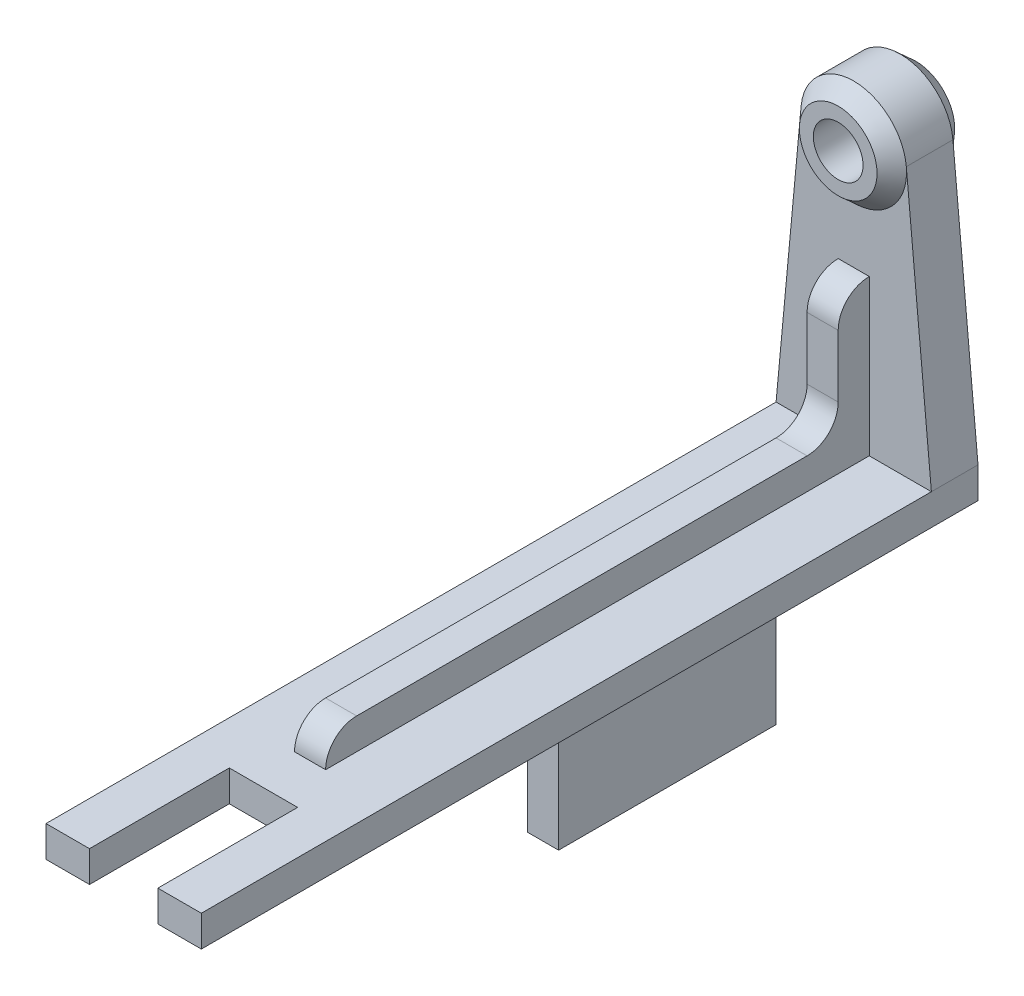
ISO-10303-21;
HEADER;
FILE_DESCRIPTION(('STEP AP214'),'2;1');
FILE_NAME('part.step','',(''),(''),'','','');
FILE_SCHEMA(('AUTOMOTIVE_DESIGN { 1 0 10303 214 1 1 1 1 }'));
ENDSEC;
DATA;
#1=APPLICATION_CONTEXT('core data for automotive mechanical design processes');
#2=APPLICATION_PROTOCOL_DEFINITION('international standard','automotive_design',2000,#1);
#3=PRODUCT_CONTEXT('',#1,'mechanical');
#4=PRODUCT('Part','Part','',(#3));
#5=PRODUCT_RELATED_PRODUCT_CATEGORY('part','',(#4));
#6=PRODUCT_DEFINITION_FORMATION('','',#4);
#7=PRODUCT_DEFINITION_CONTEXT('part definition',#1,'design');
#8=PRODUCT_DEFINITION('design','',#6,#7);
#9=PRODUCT_DEFINITION_SHAPE('','',#8);
#10=(LENGTH_UNIT() NAMED_UNIT(*) SI_UNIT(.MILLI.,.METRE.));
#11=(NAMED_UNIT(*) PLANE_ANGLE_UNIT() SI_UNIT($,.RADIAN.));
#12=(NAMED_UNIT(*) SI_UNIT($,.STERADIAN.) SOLID_ANGLE_UNIT());
#13=UNCERTAINTY_MEASURE_WITH_UNIT(LENGTH_MEASURE(1.E-05),#10,'distance_accuracy_value','');
#14=(GEOMETRIC_REPRESENTATION_CONTEXT(3) GLOBAL_UNCERTAINTY_ASSIGNED_CONTEXT((#13)) GLOBAL_UNIT_ASSIGNED_CONTEXT((#10,
#11,#12)) REPRESENTATION_CONTEXT('',''));
#15=CARTESIAN_POINT('',(0.,0.,0.));
#16=DIRECTION('',(0.,0.,1.));
#17=DIRECTION('',(1.,0.,0.));
#18=AXIS2_PLACEMENT_3D('',#15,#16,#17);
#19=CARTESIAN_POINT('',(0.,0.,242.5));
#20=DIRECTION('',(0.,0.,-1.));
#21=DIRECTION('',(-1.,0.,0.));
#22=AXIS2_PLACEMENT_3D('',#19,#20,#21);
#23=PLANE('',#22);
#24=DIRECTION('',(0.,1.,0.));
#25=VECTOR('',#24,1.);
#26=CARTESIAN_POINT('',(11.,0.,242.5));
#27=LINE('',#26,#25);
#28=CARTESIAN_POINT('',(11.,-95.,242.5));
#29=VERTEX_POINT('',#28);
#30=CARTESIAN_POINT('',(11.,-85.,242.5));
#31=VERTEX_POINT('',#30);
#32=EDGE_CURVE('E372',#29,#31,#27,.T.);
#33=ORIENTED_EDGE('',*,*,#32,.F.);
#34=DIRECTION('',(1.,0.,0.));
#35=VECTOR('',#34,1.);
#36=CARTESIAN_POINT('',(-25.,-95.,242.5));
#37=LINE('',#36,#35);
#38=CARTESIAN_POINT('',(25.,-95.,242.5));
#39=VERTEX_POINT('',#38);
#40=EDGE_CURVE('E207',#29,#39,#37,.T.);
#41=ORIENTED_EDGE('',*,*,#40,.T.);
#42=DIRECTION('',(0.,1.,0.));
#43=VECTOR('',#42,1.);
#44=CARTESIAN_POINT('',(25.,-95.,242.5));
#45=LINE('',#44,#43);
#46=CARTESIAN_POINT('',(25.,-85.,242.5));
#47=VERTEX_POINT('',#46);
#48=EDGE_CURVE('E319',#39,#47,#45,.T.);
#49=ORIENTED_EDGE('',*,*,#48,.T.);
#50=DIRECTION('',(-1.,0.,0.));
#51=VECTOR('',#50,1.);
#52=CARTESIAN_POINT('',(-25.,-85.,242.5));
#53=LINE('',#52,#51);
#54=EDGE_CURVE('E322',#47,#31,#53,.T.);
#55=ORIENTED_EDGE('',*,*,#54,.T.);
#56=EDGE_LOOP('',(#33,#41,#49,#55));
#57=FACE_BOUND('',#56,.T.);
#58=ADVANCED_FACE('F33',(#57),#23,.F.);
#59=CARTESIAN_POINT('',(0.,0.,7.5));
#60=DIRECTION('',(0.,0.,1.));
#61=DIRECTION('',(1.,0.,0.));
#62=AXIS2_PLACEMENT_3D('',#59,#60,#61);
#63=PLANE('',#62);
#64=DIRECTION('',(0.,1.,0.));
#65=VECTOR('',#64,1.);
#66=CARTESIAN_POINT('',(5.,-85.,7.5));
#67=LINE('',#66,#65);
#68=CARTESIAN_POINT('',(5.,-85.,7.5));
#69=VERTEX_POINT('',#68);
#70=CARTESIAN_POINT('',(5.,-35.,7.5));
#71=VERTEX_POINT('',#70);
#72=EDGE_CURVE('E251',#69,#71,#67,.T.);
#73=ORIENTED_EDGE('',*,*,#72,.F.);
#74=DIRECTION('',(-1.,0.,0.));
#75=VECTOR('',#74,1.);
#76=CARTESIAN_POINT('',(-25.,-85.,7.5));
#77=LINE('',#76,#75);
#78=CARTESIAN_POINT('',(25.,-85.,7.5));
#79=VERTEX_POINT('',#78);
#80=EDGE_CURVE('E315',#79,#69,#77,.T.);
#81=ORIENTED_EDGE('',*,*,#80,.F.);
#82=DIRECTION('',(-0.0928471682589601,0.995680372080465,0.));
#83=VECTOR('',#82,1.);
#84=CARTESIAN_POINT('',(25.,-85.,7.5));
#85=LINE('',#84,#83);
#86=CARTESIAN_POINT('',(16.9265663253679,1.57840186040232,7.50000000000006));
#87=VERTEX_POINT('',#86);
#88=EDGE_CURVE('E334',#79,#87,#85,.T.);
#89=ORIENTED_EDGE('',*,*,#88,.T.);
#90=CARTESIAN_POINT('',(0.,0.,7.5));
#91=DIRECTION('',(0.,0.,1.));
#92=DIRECTION('',(1.,0.,0.));
#93=AXIS2_PLACEMENT_3D('',#90,#91,#92);
#94=CIRCLE('',#93,17.0000000000001);
#95=CARTESIAN_POINT('',(-16.9265663253679,1.57840186040232,7.5));
#96=VERTEX_POINT('',#95);
#97=EDGE_CURVE('E363',#87,#96,#94,.F.);
#98=ORIENTED_EDGE('',*,*,#97,.T.);
#99=DIRECTION('',(-0.0928471682589601,-0.995680372080465,0.));
#100=VECTOR('',#99,1.);
#101=CARTESIAN_POINT('',(-25.,-85.,7.5));
#102=LINE('',#101,#100);
#103=CARTESIAN_POINT('',(-25.,-85.,7.5));
#104=VERTEX_POINT('',#103);
#105=EDGE_CURVE('E340',#96,#104,#102,.T.);
#106=ORIENTED_EDGE('',*,*,#105,.T.);
#107=CARTESIAN_POINT('',(-5.,-85.,7.5));
#108=VERTEX_POINT('',#107);
#109=EDGE_CURVE('E311',#108,#104,#77,.T.);
#110=ORIENTED_EDGE('',*,*,#109,.F.);
#111=DIRECTION('',(0.,1.,0.));
#112=VECTOR('',#111,1.);
#113=CARTESIAN_POINT('',(-5.,-85.,7.5));
#114=LINE('',#113,#112);
#115=CARTESIAN_POINT('',(-5.,-35.,7.5));
#116=VERTEX_POINT('',#115);
#117=EDGE_CURVE('E269',#108,#116,#114,.T.);
#118=ORIENTED_EDGE('',*,*,#117,.T.);
#119=DIRECTION('',(-1.,0.,0.));
#120=VECTOR('',#119,1.);
#121=CARTESIAN_POINT('',(5.,-35.,7.5));
#122=LINE('',#121,#120);
#123=EDGE_CURVE('E294',#71,#116,#122,.T.);
#124=ORIENTED_EDGE('',*,*,#123,.F.);
#125=EDGE_LOOP('',(#73,#81,#89,#98,#106,#110,#118,#124));
#126=FACE_BOUND('',#125,.T.);
#127=ADVANCED_FACE('F421',(#126),#63,.T.);
#128=CARTESIAN_POINT('',(25.,-85.,7.5));
#129=DIRECTION('',(-1.,0.,0.));
#130=DIRECTION('',(0.,-1.,0.));
#131=AXIS2_PLACEMENT_3D('',#128,#129,#130);
#132=PLANE('',#131);
#133=DIRECTION('',(0.,1.,0.));
#134=VECTOR('',#133,1.);
#135=CARTESIAN_POINT('',(25.,-85.,-7.5));
#136=LINE('',#135,#134);
#137=CARTESIAN_POINT('',(25.,-95.,-7.5));
#138=VERTEX_POINT('',#137);
#139=CARTESIAN_POINT('',(25.,-85.,-7.5));
#140=VERTEX_POINT('',#139);
#141=EDGE_CURVE('E333',#138,#140,#136,.T.);
#142=ORIENTED_EDGE('',*,*,#141,.T.);
#143=DIRECTION('',(0.,0.,-1.));
#144=VECTOR('',#143,1.);
#145=CARTESIAN_POINT('',(25.,-85.,7.5));
#146=LINE('',#145,#144);
#147=EDGE_CURVE('E360',#79,#140,#146,.T.);
#148=ORIENTED_EDGE('',*,*,#147,.F.);
#149=DIRECTION('',(0.,0.,-1.));
#150=VECTOR('',#149,1.);
#151=CARTESIAN_POINT('',(25.,-85.,242.5));
#152=LINE('',#151,#150);
#153=EDGE_CURVE('E330',#47,#79,#152,.T.);
#154=ORIENTED_EDGE('',*,*,#153,.F.);
#155=ORIENTED_EDGE('',*,*,#48,.F.);
#156=DIRECTION('',(0.,0.,-1.));
#157=VECTOR('',#156,1.);
#158=CARTESIAN_POINT('',(25.,-95.,7.5));
#159=LINE('',#158,#157);
#160=EDGE_CURVE('E343',#39,#138,#159,.T.);
#161=ORIENTED_EDGE('',*,*,#160,.T.);
#162=EDGE_LOOP('',(#142,#148,#154,#155,#161));
#163=FACE_BOUND('',#162,.T.);
#164=ADVANCED_FACE('F35',(#163),#132,.F.);
#165=CARTESIAN_POINT('',(25.,-85.,7.5));
#166=DIRECTION('',(-0.995680372080465,-0.0928471682589601,0.));
#167=DIRECTION('',(0.0928471682589601,-0.995680372080465,0.));
#168=AXIS2_PLACEMENT_3D('',#165,#166,#167);
#169=PLANE('',#168);
#170=DIRECTION('',(-0.0928471682589601,0.995680372080465,0.));
#171=VECTOR('',#170,1.);
#172=CARTESIAN_POINT('',(25.,-85.,-7.5));
#173=LINE('',#172,#171);
#174=CARTESIAN_POINT('',(16.9265663253679,1.57840186040232,-7.5));
#175=VERTEX_POINT('',#174);
#176=EDGE_CURVE('E346',#140,#175,#173,.T.);
#177=ORIENTED_EDGE('',*,*,#176,.T.);
#178=DIRECTION('',(0.,0.,-1.));
#179=VECTOR('',#178,1.);
#180=CARTESIAN_POINT('',(16.9265663253679,1.57840186040232,7.5));
#181=LINE('',#180,#179);
#182=EDGE_CURVE('E364',#87,#175,#181,.T.);
#183=ORIENTED_EDGE('',*,*,#182,.F.);
#184=ORIENTED_EDGE('',*,*,#88,.F.);
#185=ORIENTED_EDGE('',*,*,#147,.T.);
#186=EDGE_LOOP('',(#177,#183,#184,#185));
#187=FACE_BOUND('',#186,.T.);
#188=ADVANCED_FACE('F456',(#187),#169,.F.);
#189=CARTESIAN_POINT('',(0.,0.,7.5));
#190=DIRECTION('',(0.,0.,-1.));
#191=DIRECTION('',(-1.,0.,0.));
#192=AXIS2_PLACEMENT_3D('',#189,#190,#191);
#193=CYLINDRICAL_SURFACE('',#192,17.);
#194=CARTESIAN_POINT('',(0.,0.,-7.5));
#195=DIRECTION('',(0.,0.,1.));
#196=DIRECTION('',(1.,0.,0.));
#197=AXIS2_PLACEMENT_3D('',#194,#195,#196);
#198=CIRCLE('',#197,17.);
#199=CARTESIAN_POINT('',(-16.9265663253679,1.57840186040232,-7.50000000000006));
#200=VERTEX_POINT('',#199);
#201=EDGE_CURVE('E375',#175,#200,#198,.T.);
#202=ORIENTED_EDGE('',*,*,#201,.T.);
#203=DIRECTION('',(0.,0.,-1.));
#204=VECTOR('',#203,1.);
#205=CARTESIAN_POINT('',(-16.9265663253679,1.57840186040232,7.5));
#206=LINE('',#205,#204);
#207=EDGE_CURVE('E359',#96,#200,#206,.T.);
#208=ORIENTED_EDGE('',*,*,#207,.F.);
#209=CARTESIAN_POINT('',(0.,0.,7.5));
#210=DIRECTION('',(0.,0.,1.));
#211=DIRECTION('',(1.,0.,0.));
#212=AXIS2_PLACEMENT_3D('',#209,#210,#211);
#213=CIRCLE('',#212,17.);
#214=EDGE_CURVE('E337',#87,#96,#213,.T.);
#215=ORIENTED_EDGE('',*,*,#214,.F.);
#216=ORIENTED_EDGE('',*,*,#182,.T.);
#217=EDGE_LOOP('',(#202,#208,#215,#216));
#218=FACE_BOUND('',#217,.T.);
#219=ADVANCED_FACE('F453',(#218),#193,.T.);
#220=CARTESIAN_POINT('',(-25.,-85.,7.5));
#221=DIRECTION('',(0.995680372080465,-0.0928471682589601,0.));
#222=DIRECTION('',(0.0928471682589601,0.995680372080465,0.));
#223=AXIS2_PLACEMENT_3D('',#220,#221,#222);
#224=PLANE('',#223);
#225=DIRECTION('',(-0.0928471682589601,-0.995680372080465,0.));
#226=VECTOR('',#225,1.);
#227=CARTESIAN_POINT('',(-25.,-85.,-7.5));
#228=LINE('',#227,#226);
#229=CARTESIAN_POINT('',(-25.,-85.,-7.5));
#230=VERTEX_POINT('',#229);
#231=EDGE_CURVE('E349',#200,#230,#228,.T.);
#232=ORIENTED_EDGE('',*,*,#231,.T.);
#233=DIRECTION('',(0.,0.,-1.));
#234=VECTOR('',#233,1.);
#235=CARTESIAN_POINT('',(-25.,-85.,7.5));
#236=LINE('',#235,#234);
#237=EDGE_CURVE('E356',#104,#230,#236,.T.);
#238=ORIENTED_EDGE('',*,*,#237,.F.);
#239=ORIENTED_EDGE('',*,*,#105,.F.);
#240=ORIENTED_EDGE('',*,*,#207,.T.);
#241=EDGE_LOOP('',(#232,#238,#239,#240));
#242=FACE_BOUND('',#241,.T.);
#243=ADVANCED_FACE('F450',(#242),#224,.F.);
#244=CARTESIAN_POINT('',(-25.,-85.,7.5));
#245=DIRECTION('',(1.,0.,0.));
#246=DIRECTION('',(0.,1.,0.));
#247=AXIS2_PLACEMENT_3D('',#244,#245,#246);
#248=PLANE('',#247);
#249=DIRECTION('',(0.,-1.,0.));
#250=VECTOR('',#249,1.);
#251=CARTESIAN_POINT('',(-25.,-85.,-7.5));
#252=LINE('',#251,#250);
#253=CARTESIAN_POINT('',(-25.,-95.,-7.5));
#254=VERTEX_POINT('',#253);
#255=EDGE_CURVE('E347',#230,#254,#252,.T.);
#256=ORIENTED_EDGE('',*,*,#255,.T.);
#257=DIRECTION('',(0.,0.,-1.));
#258=VECTOR('',#257,1.);
#259=CARTESIAN_POINT('',(-25.,-95.,7.5));
#260=LINE('',#259,#258);
#261=CARTESIAN_POINT('',(-25.,-95.,242.5));
#262=VERTEX_POINT('',#261);
#263=EDGE_CURVE('E353',#262,#254,#260,.T.);
#264=ORIENTED_EDGE('',*,*,#263,.F.);
#265=DIRECTION('',(0.,-1.,0.));
#266=VECTOR('',#265,1.);
#267=CARTESIAN_POINT('',(-25.,-95.,242.5));
#268=LINE('',#267,#266);
#269=CARTESIAN_POINT('',(-25.,-85.,242.5));
#270=VERTEX_POINT('',#269);
#271=EDGE_CURVE('E312',#270,#262,#268,.T.);
#272=ORIENTED_EDGE('',*,*,#271,.F.);
#273=DIRECTION('',(0.,0.,-1.));
#274=VECTOR('',#273,1.);
#275=CARTESIAN_POINT('',(-25.,-85.,242.5));
#276=LINE('',#275,#274);
#277=EDGE_CURVE('E325',#270,#104,#276,.T.);
#278=ORIENTED_EDGE('',*,*,#277,.T.);
#279=ORIENTED_EDGE('',*,*,#237,.T.);
#280=EDGE_LOOP('',(#256,#264,#272,#278,#279));
#281=FACE_BOUND('',#280,.T.);
#282=ADVANCED_FACE('F406',(#281),#248,.F.);
#283=CARTESIAN_POINT('',(-25.,-95.,7.5));
#284=DIRECTION('',(0.,1.,0.));
#285=DIRECTION('',(0.,0.,1.));
#286=AXIS2_PLACEMENT_3D('',#283,#284,#285);
#287=PLANE('',#286);
#288=DIRECTION('',(-1.,0.,0.));
#289=VECTOR('',#288,1.);
#290=CARTESIAN_POINT('',(5.,-95.,107.5));
#291=LINE('',#290,#289);
#292=CARTESIAN_POINT('',(5.,-95.,107.5));
#293=VERTEX_POINT('',#292);
#294=CARTESIAN_POINT('',(-5.,-95.,107.5));
#295=VERTEX_POINT('',#294);
#296=EDGE_CURVE('E56',#293,#295,#291,.T.);
#297=ORIENTED_EDGE('',*,*,#296,.F.);
#298=DIRECTION('',(0.,0.,1.));
#299=VECTOR('',#298,1.);
#300=CARTESIAN_POINT('',(5.,-95.,107.5));
#301=LINE('',#300,#299);
#302=CARTESIAN_POINT('',(5.,-95.,37.5));
#303=VERTEX_POINT('',#302);
#304=EDGE_CURVE('E224',#303,#293,#301,.T.);
#305=ORIENTED_EDGE('',*,*,#304,.F.);
#306=DIRECTION('',(-1.,0.,0.));
#307=VECTOR('',#306,1.);
#308=CARTESIAN_POINT('',(5.,-95.,37.5));
#309=LINE('',#308,#307);
#310=CARTESIAN_POINT('',(-5.,-95.,37.5));
#311=VERTEX_POINT('',#310);
#312=EDGE_CURVE('E235',#303,#311,#309,.T.);
#313=ORIENTED_EDGE('',*,*,#312,.T.);
#314=DIRECTION('',(0.,0.,1.));
#315=VECTOR('',#314,1.);
#316=CARTESIAN_POINT('',(-5.,-95.,107.5));
#317=LINE('',#316,#315);
#318=EDGE_CURVE('E219',#311,#295,#317,.T.);
#319=ORIENTED_EDGE('',*,*,#318,.T.);
#320=EDGE_LOOP('',(#297,#305,#313,#319));
#321=FACE_BOUND('',#320,.T.);
#322=DIRECTION('',(-1.,0.,0.));
#323=VECTOR('',#322,1.);
#324=CARTESIAN_POINT('',(-25.,-95.,197.5));
#325=LINE('',#324,#323);
#326=CARTESIAN_POINT('',(11.,-95.,197.5));
#327=VERTEX_POINT('',#326);
#328=CARTESIAN_POINT('',(-11.,-95.,197.5));
#329=VERTEX_POINT('',#328);
#330=EDGE_CURVE('E190',#327,#329,#325,.T.);
#331=ORIENTED_EDGE('',*,*,#330,.T.);
#332=DIRECTION('',(0.,0.,1.));
#333=VECTOR('',#332,1.);
#334=CARTESIAN_POINT('',(-11.,-95.,7.5));
#335=LINE('',#334,#333);
#336=CARTESIAN_POINT('',(-11.,-95.,242.5));
#337=VERTEX_POINT('',#336);
#338=EDGE_CURVE('E198',#329,#337,#335,.T.);
#339=ORIENTED_EDGE('',*,*,#338,.T.);
#340=EDGE_CURVE('E316',#262,#337,#37,.T.);
#341=ORIENTED_EDGE('',*,*,#340,.F.);
#342=ORIENTED_EDGE('',*,*,#263,.T.);
#343=DIRECTION('',(1.,0.,0.));
#344=VECTOR('',#343,1.);
#345=CARTESIAN_POINT('',(-25.,-95.,-7.5));
#346=LINE('',#345,#344);
#347=EDGE_CURVE('E338',#254,#138,#346,.T.);
#348=ORIENTED_EDGE('',*,*,#347,.T.);
#349=ORIENTED_EDGE('',*,*,#160,.F.);
#350=ORIENTED_EDGE('',*,*,#40,.F.);
#351=DIRECTION('',(0.,0.,1.));
#352=VECTOR('',#351,1.);
#353=CARTESIAN_POINT('',(11.,-95.,7.5));
#354=LINE('',#353,#352);
#355=EDGE_CURVE('E48',#327,#29,#354,.T.);
#356=ORIENTED_EDGE('',*,*,#355,.F.);
#357=EDGE_LOOP('',(#331,#339,#341,#342,#348,#349,#350,#356));
#358=FACE_BOUND('',#357,.T.);
#359=ADVANCED_FACE('F205',(#321,#358),#287,.F.);
#360=CARTESIAN_POINT('',(0.,0.,-7.5));
#361=DIRECTION('',(0.,0.,1.));
#362=DIRECTION('',(1.,0.,0.));
#363=AXIS2_PLACEMENT_3D('',#360,#361,#362);
#364=PLANE('',#363);
#365=ORIENTED_EDGE('',*,*,#231,.F.);
#366=CARTESIAN_POINT('',(0.,0.,-7.50000000000006));
#367=DIRECTION('',(0.,0.,1.));
#368=DIRECTION('',(1.,0.,0.));
#369=AXIS2_PLACEMENT_3D('',#366,#367,#368);
#370=CIRCLE('',#369,17.);
#371=EDGE_CURVE('E367',#200,#175,#370,.T.);
#372=ORIENTED_EDGE('',*,*,#371,.T.);
#373=ORIENTED_EDGE('',*,*,#176,.F.);
#374=ORIENTED_EDGE('',*,*,#141,.F.);
#375=ORIENTED_EDGE('',*,*,#347,.F.);
#376=ORIENTED_EDGE('',*,*,#255,.F.);
#377=EDGE_LOOP('',(#365,#372,#373,#374,#375,#376));
#378=FACE_BOUND('',#377,.T.);
#379=ADVANCED_FACE('F439',(#378),#364,.F.);
#380=CARTESIAN_POINT('',(-25.,-85.,242.5));
#381=DIRECTION('',(0.,-1.,0.));
#382=DIRECTION('',(0.,0.,-1.));
#383=AXIS2_PLACEMENT_3D('',#380,#381,#382);
#384=PLANE('',#383);
#385=CARTESIAN_POINT('',(-11.,-85.,242.5));
#386=VERTEX_POINT('',#385);
#387=EDGE_CURVE('E321',#386,#270,#53,.T.);
#388=ORIENTED_EDGE('',*,*,#387,.F.);
#389=DIRECTION('',(0.,0.,-1.));
#390=VECTOR('',#389,1.);
#391=CARTESIAN_POINT('',(-11.,-85.,242.5));
#392=LINE('',#391,#390);
#393=CARTESIAN_POINT('',(-11.,-85.,197.5));
#394=VERTEX_POINT('',#393);
#395=EDGE_CURVE('E208',#386,#394,#392,.T.);
#396=ORIENTED_EDGE('',*,*,#395,.T.);
#397=DIRECTION('',(1.,0.,0.));
#398=VECTOR('',#397,1.);
#399=CARTESIAN_POINT('',(-25.,-85.,197.5));
#400=LINE('',#399,#398);
#401=CARTESIAN_POINT('',(11.,-85.,197.5));
#402=VERTEX_POINT('',#401);
#403=EDGE_CURVE('E11',#394,#402,#400,.T.);
#404=ORIENTED_EDGE('',*,*,#403,.T.);
#405=DIRECTION('',(0.,0.,-1.));
#406=VECTOR('',#405,1.);
#407=CARTESIAN_POINT('',(11.,-85.,242.5));
#408=LINE('',#407,#406);
#409=EDGE_CURVE('E202',#31,#402,#408,.T.);
#410=ORIENTED_EDGE('',*,*,#409,.F.);
#411=ORIENTED_EDGE('',*,*,#54,.F.);
#412=ORIENTED_EDGE('',*,*,#153,.T.);
#413=ORIENTED_EDGE('',*,*,#80,.T.);
#414=DIRECTION('',(0.,0.,-1.));
#415=VECTOR('',#414,1.);
#416=CARTESIAN_POINT('',(5.,-85.,182.5));
#417=LINE('',#416,#415);
#418=CARTESIAN_POINT('',(5.,-85.,182.5));
#419=VERTEX_POINT('',#418);
#420=EDGE_CURVE('E247',#419,#69,#417,.T.);
#421=ORIENTED_EDGE('',*,*,#420,.F.);
#422=DIRECTION('',(-1.,0.,0.));
#423=VECTOR('',#422,1.);
#424=CARTESIAN_POINT('',(5.,-85.,182.5));
#425=LINE('',#424,#423);
#426=CARTESIAN_POINT('',(-5.,-85.,182.5));
#427=VERTEX_POINT('',#426);
#428=EDGE_CURVE('E297',#419,#427,#425,.T.);
#429=ORIENTED_EDGE('',*,*,#428,.T.);
#430=DIRECTION('',(0.,0.,-1.));
#431=VECTOR('',#430,1.);
#432=CARTESIAN_POINT('',(-5.,-85.,182.5));
#433=LINE('',#432,#431);
#434=EDGE_CURVE('E267',#427,#108,#433,.T.);
#435=ORIENTED_EDGE('',*,*,#434,.T.);
#436=ORIENTED_EDGE('',*,*,#109,.T.);
#437=ORIENTED_EDGE('',*,*,#277,.F.);
#438=EDGE_LOOP('',(#388,#396,#404,#410,#411,#412,#413,#421,#429,#435,#436,#437));
#439=FACE_BOUND('',#438,.T.);
#440=ADVANCED_FACE('F401',(#439),#384,.F.);
#441=ORIENTED_EDGE('',*,*,#340,.T.);
#442=DIRECTION('',(0.,1.,0.));
#443=VECTOR('',#442,1.);
#444=CARTESIAN_POINT('',(-11.,0.,242.5));
#445=LINE('',#444,#443);
#446=EDGE_CURVE('E41',#337,#386,#445,.T.);
#447=ORIENTED_EDGE('',*,*,#446,.T.);
#448=ORIENTED_EDGE('',*,*,#387,.T.);
#449=ORIENTED_EDGE('',*,*,#271,.T.);
#450=EDGE_LOOP('',(#441,#447,#448,#449));
#451=FACE_BOUND('',#450,.T.);
#452=ADVANCED_FACE('F396',(#451),#23,.F.);
#453=CARTESIAN_POINT('',(0.,0.,7.50000000000006));
#454=DIRECTION('',(0.,0.,-1.));
#455=DIRECTION('',(-1.,0.,0.));
#456=AXIS2_PLACEMENT_3D('',#453,#454,#455);
#457=CONICAL_SURFACE('',#456,17.,0.732815101786518);
#458=CARTESIAN_POINT('',(0.,0.,12.5));
#459=DIRECTION('',(0.,0.,1.));
#460=DIRECTION('',(1.,0.,0.));
#461=AXIS2_PLACEMENT_3D('',#458,#459,#460);
#462=CIRCLE('',#461,12.5);
#463=CARTESIAN_POINT('',(12.5,0.,12.5));
#464=VERTEX_POINT('',#463);
#465=EDGE_CURVE('E305',#464,#464,#462,.T.);
#466=ORIENTED_EDGE('',*,*,#465,.F.);
#467=EDGE_LOOP('',(#466));
#468=FACE_BOUND('',#467,.T.);
#469=ORIENTED_EDGE('',*,*,#214,.T.);
#470=ORIENTED_EDGE('',*,*,#97,.F.);
#471=EDGE_LOOP('',(#469,#470));
#472=FACE_BOUND('',#471,.T.);
#473=ADVANCED_FACE('F432',(#468,#472),#457,.T.);
#474=CARTESIAN_POINT('',(0.,0.,1025.));
#475=DIRECTION('',(0.,0.,1.));
#476=DIRECTION('',(1.,0.,0.));
#477=AXIS2_PLACEMENT_3D('',#474,#475,#476);
#478=CYLINDRICAL_SURFACE('',#477,8.);
#479=CARTESIAN_POINT('',(0.,0.,12.5));
#480=DIRECTION('',(0.,0.,1.));
#481=DIRECTION('',(1.,0.,0.));
#482=AXIS2_PLACEMENT_3D('',#479,#480,#481);
#483=CIRCLE('',#482,8.);
#484=CARTESIAN_POINT('',(8.,0.,12.5));
#485=VERTEX_POINT('',#484);
#486=EDGE_CURVE('E308',#485,#485,#483,.T.);
#487=ORIENTED_EDGE('',*,*,#486,.T.);
#488=EDGE_LOOP('',(#487));
#489=FACE_BOUND('',#488,.T.);
#490=CARTESIAN_POINT('',(0.,0.,-12.5));
#491=DIRECTION('',(0.,0.,1.));
#492=DIRECTION('',(1.,0.,0.));
#493=AXIS2_PLACEMENT_3D('',#490,#491,#492);
#494=CIRCLE('',#493,8.00000000000001);
#495=CARTESIAN_POINT('',(8.00000000000001,0.,-12.5));
#496=VERTEX_POINT('',#495);
#497=EDGE_CURVE('E299',#496,#496,#494,.T.);
#498=ORIENTED_EDGE('',*,*,#497,.F.);
#499=EDGE_LOOP('',(#498));
#500=FACE_BOUND('',#499,.T.);
#501=ADVANCED_FACE('F437',(#489,#500),#478,.F.);
#502=CARTESIAN_POINT('',(0.,8.,12.5));
#503=DIRECTION('',(0.,0.,-1.));
#504=DIRECTION('',(-1.,0.,0.));
#505=AXIS2_PLACEMENT_3D('',#502,#503,#504);
#506=PLANE('',#505);
#507=ORIENTED_EDGE('',*,*,#486,.F.);
#508=EDGE_LOOP('',(#507));
#509=FACE_BOUND('',#508,.T.);
#510=ORIENTED_EDGE('',*,*,#465,.T.);
#511=EDGE_LOOP('',(#510));
#512=FACE_BOUND('',#511,.T.);
#513=ADVANCED_FACE('F487',(#509,#512),#506,.F.);
#514=CARTESIAN_POINT('',(0.,8.00000000000001,-12.5));
#515=DIRECTION('',(0.,0.,1.));
#516=DIRECTION('',(1.,0.,0.));
#517=AXIS2_PLACEMENT_3D('',#514,#515,#516);
#518=PLANE('',#517);
#519=CARTESIAN_POINT('',(0.,0.,-12.5));
#520=DIRECTION('',(0.,0.,1.));
#521=DIRECTION('',(1.,0.,0.));
#522=AXIS2_PLACEMENT_3D('',#519,#520,#521);
#523=CIRCLE('',#522,12.5);
#524=CARTESIAN_POINT('',(12.5,0.,-12.5));
#525=VERTEX_POINT('',#524);
#526=EDGE_CURVE('E302',#525,#525,#523,.T.);
#527=ORIENTED_EDGE('',*,*,#526,.F.);
#528=EDGE_LOOP('',(#527));
#529=FACE_BOUND('',#528,.T.);
#530=ORIENTED_EDGE('',*,*,#497,.T.);
#531=EDGE_LOOP('',(#530));
#532=FACE_BOUND('',#531,.T.);
#533=ADVANCED_FACE('F481',(#529,#532),#518,.F.);
#534=CARTESIAN_POINT('',(0.,0.,-12.5));
#535=DIRECTION('',(0.,0.,1.));
#536=DIRECTION('',(1.,0.,0.));
#537=AXIS2_PLACEMENT_3D('',#534,#535,#536);
#538=CONICAL_SURFACE('',#537,12.5,0.732815101786517);
#539=ORIENTED_EDGE('',*,*,#201,.F.);
#540=ORIENTED_EDGE('',*,*,#371,.F.);
#541=EDGE_LOOP('',(#539,#540));
#542=FACE_BOUND('',#541,.T.);
#543=ORIENTED_EDGE('',*,*,#526,.T.);
#544=EDGE_LOOP('',(#543));
#545=FACE_BOUND('',#544,.T.);
#546=ADVANCED_FACE('F477',(#542,#545),#538,.T.);
#547=CARTESIAN_POINT('',(5.,-85.,172.5));
#548=DIRECTION('',(-1.,0.,0.));
#549=DIRECTION('',(0.,0.,1.));
#550=AXIS2_PLACEMENT_3D('',#547,#548,#549);
#551=CYLINDRICAL_SURFACE('',#550,10.);
#552=CARTESIAN_POINT('',(-5.,-85.,172.5));
#553=DIRECTION('',(1.,0.,0.));
#554=DIRECTION('',(0.,0.,-1.));
#555=AXIS2_PLACEMENT_3D('',#552,#553,#554);
#556=CIRCLE('',#555,10.);
#557=CARTESIAN_POINT('',(-5.,-75.,172.5));
#558=VERTEX_POINT('',#557);
#559=EDGE_CURVE('E243',#558,#427,#556,.T.);
#560=ORIENTED_EDGE('',*,*,#559,.T.);
#561=ORIENTED_EDGE('',*,*,#428,.F.);
#562=CARTESIAN_POINT('',(5.,-85.,172.5));
#563=DIRECTION('',(1.,0.,0.));
#564=DIRECTION('',(0.,0.,-1.));
#565=AXIS2_PLACEMENT_3D('',#562,#563,#564);
#566=CIRCLE('',#565,10.);
#567=CARTESIAN_POINT('',(5.,-75.,172.5));
#568=VERTEX_POINT('',#567);
#569=EDGE_CURVE('E244',#568,#419,#566,.T.);
#570=ORIENTED_EDGE('',*,*,#569,.F.);
#571=DIRECTION('',(-1.,0.,0.));
#572=VECTOR('',#571,1.);
#573=CARTESIAN_POINT('',(5.,-75.,172.5));
#574=LINE('',#573,#572);
#575=EDGE_CURVE('E264',#568,#558,#574,.T.);
#576=ORIENTED_EDGE('',*,*,#575,.T.);
#577=EDGE_LOOP('',(#560,#561,#570,#576));
#578=FACE_BOUND('',#577,.T.);
#579=ADVANCED_FACE('F480',(#578),#551,.T.);
#580=CARTESIAN_POINT('',(5.,-35.,7.50941680764456));
#581=DIRECTION('',(0.,-1.,0.));
#582=DIRECTION('',(0.,0.,-1.));
#583=AXIS2_PLACEMENT_3D('',#580,#581,#582);
#584=PLANE('',#583);
#585=DIRECTION('',(0.,0.,1.));
#586=VECTOR('',#585,1.);
#587=CARTESIAN_POINT('',(-5.,-35.,7.50941680764456));
#588=LINE('',#587,#586);
#589=CARTESIAN_POINT('',(-5.,-35.,7.50941680764456));
#590=VERTEX_POINT('',#589);
#591=EDGE_CURVE('E271',#116,#590,#588,.T.);
#592=ORIENTED_EDGE('',*,*,#591,.T.);
#593=DIRECTION('',(-1.,0.,0.));
#594=VECTOR('',#593,1.);
#595=CARTESIAN_POINT('',(5.,-35.,7.50941680764456));
#596=LINE('',#595,#594);
#597=CARTESIAN_POINT('',(5.,-35.,7.50941680764456));
#598=VERTEX_POINT('',#597);
#599=EDGE_CURVE('E291',#598,#590,#596,.T.);
#600=ORIENTED_EDGE('',*,*,#599,.F.);
#601=DIRECTION('',(0.,0.,1.));
#602=VECTOR('',#601,1.);
#603=CARTESIAN_POINT('',(5.,-35.,7.50941680764456));
#604=LINE('',#603,#602);
#605=EDGE_CURVE('E254',#71,#598,#604,.T.);
#606=ORIENTED_EDGE('',*,*,#605,.F.);
#607=ORIENTED_EDGE('',*,*,#123,.T.);
#608=EDGE_LOOP('',(#592,#600,#606,#607));
#609=FACE_BOUND('',#608,.T.);
#610=ADVANCED_FACE('F502',(#609),#584,.F.);
#611=CARTESIAN_POINT('',(5.,-45.,7.50941680764456));
#612=DIRECTION('',(-1.,0.,0.));
#613=DIRECTION('',(0.,0.,1.));
#614=AXIS2_PLACEMENT_3D('',#611,#612,#613);
#615=CYLINDRICAL_SURFACE('',#614,10.);
#616=CARTESIAN_POINT('',(-5.,-45.,7.50941680764456));
#617=DIRECTION('',(1.,0.,0.));
#618=DIRECTION('',(0.,0.,-1.));
#619=AXIS2_PLACEMENT_3D('',#616,#617,#618);
#620=CIRCLE('',#619,10.);
#621=CARTESIAN_POINT('',(-5.,-45.,17.5094168076446));
#622=VERTEX_POINT('',#621);
#623=EDGE_CURVE('E273',#590,#622,#620,.T.);
#624=ORIENTED_EDGE('',*,*,#623,.T.);
#625=DIRECTION('',(-1.,0.,0.));
#626=VECTOR('',#625,1.);
#627=CARTESIAN_POINT('',(5.,-45.,17.5094168076446));
#628=LINE('',#627,#626);
#629=CARTESIAN_POINT('',(5.,-45.,17.5094168076446));
#630=VERTEX_POINT('',#629);
#631=EDGE_CURVE('E288',#630,#622,#628,.T.);
#632=ORIENTED_EDGE('',*,*,#631,.F.);
#633=CARTESIAN_POINT('',(5.,-45.,7.50941680764456));
#634=DIRECTION('',(1.,0.,0.));
#635=DIRECTION('',(0.,0.,-1.));
#636=AXIS2_PLACEMENT_3D('',#633,#634,#635);
#637=CIRCLE('',#636,10.);
#638=EDGE_CURVE('E256',#598,#630,#637,.T.);
#639=ORIENTED_EDGE('',*,*,#638,.F.);
#640=ORIENTED_EDGE('',*,*,#599,.T.);
#641=EDGE_LOOP('',(#624,#632,#639,#640));
#642=FACE_BOUND('',#641,.T.);
#643=ADVANCED_FACE('F506',(#642),#615,.T.);
#644=CARTESIAN_POINT('',(5.,-45.,17.5094168076446));
#645=DIRECTION('',(0.,0.,-1.));
#646=DIRECTION('',(-1.,0.,0.));
#647=AXIS2_PLACEMENT_3D('',#644,#645,#646);
#648=PLANE('',#647);
#649=DIRECTION('',(0.,-1.,0.));
#650=VECTOR('',#649,1.);
#651=CARTESIAN_POINT('',(-5.,-45.,17.5094168076446));
#652=LINE('',#651,#650);
#653=CARTESIAN_POINT('',(-5.,-65.,17.5094168076446));
#654=VERTEX_POINT('',#653);
#655=EDGE_CURVE('E275',#622,#654,#652,.T.);
#656=ORIENTED_EDGE('',*,*,#655,.T.);
#657=DIRECTION('',(-1.,0.,0.));
#658=VECTOR('',#657,1.);
#659=CARTESIAN_POINT('',(5.,-65.,17.5094168076446));
#660=LINE('',#659,#658);
#661=CARTESIAN_POINT('',(5.,-65.,17.5094168076446));
#662=VERTEX_POINT('',#661);
#663=EDGE_CURVE('E285',#662,#654,#660,.T.);
#664=ORIENTED_EDGE('',*,*,#663,.F.);
#665=DIRECTION('',(0.,-1.,0.));
#666=VECTOR('',#665,1.);
#667=CARTESIAN_POINT('',(5.,-45.,17.5094168076446));
#668=LINE('',#667,#666);
#669=EDGE_CURVE('E258',#630,#662,#668,.T.);
#670=ORIENTED_EDGE('',*,*,#669,.F.);
#671=ORIENTED_EDGE('',*,*,#631,.T.);
#672=EDGE_LOOP('',(#656,#664,#670,#671));
#673=FACE_BOUND('',#672,.T.);
#674=ADVANCED_FACE('F510',(#673),#648,.F.);
#675=CARTESIAN_POINT('',(5.,-65.,27.5094168076446));
#676=DIRECTION('',(-1.,0.,0.));
#677=DIRECTION('',(0.,0.,1.));
#678=AXIS2_PLACEMENT_3D('',#675,#676,#677);
#679=CYLINDRICAL_SURFACE('',#678,10.);
#680=CARTESIAN_POINT('',(-5.,-65.,27.5094168076446));
#681=DIRECTION('',(-1.,0.,0.));
#682=DIRECTION('',(0.,0.,1.));
#683=AXIS2_PLACEMENT_3D('',#680,#681,#682);
#684=CIRCLE('',#683,10.);
#685=CARTESIAN_POINT('',(-5.,-75.,27.5094168076446));
#686=VERTEX_POINT('',#685);
#687=EDGE_CURVE('E277',#654,#686,#684,.T.);
#688=ORIENTED_EDGE('',*,*,#687,.T.);
#689=DIRECTION('',(-1.,0.,0.));
#690=VECTOR('',#689,1.);
#691=CARTESIAN_POINT('',(5.,-75.,27.5094168076446));
#692=LINE('',#691,#690);
#693=CARTESIAN_POINT('',(5.,-75.,27.5094168076446));
#694=VERTEX_POINT('',#693);
#695=EDGE_CURVE('E282',#694,#686,#692,.T.);
#696=ORIENTED_EDGE('',*,*,#695,.F.);
#697=CARTESIAN_POINT('',(5.,-65.,27.5094168076446));
#698=DIRECTION('',(-1.,0.,0.));
#699=DIRECTION('',(0.,0.,1.));
#700=AXIS2_PLACEMENT_3D('',#697,#698,#699);
#701=CIRCLE('',#700,10.);
#702=EDGE_CURVE('E260',#662,#694,#701,.T.);
#703=ORIENTED_EDGE('',*,*,#702,.F.);
#704=ORIENTED_EDGE('',*,*,#663,.T.);
#705=EDGE_LOOP('',(#688,#696,#703,#704));
#706=FACE_BOUND('',#705,.T.);
#707=ADVANCED_FACE('F514',(#706),#679,.F.);
#708=CARTESIAN_POINT('',(5.,-75.,27.5094168076446));
#709=DIRECTION('',(0.,-1.,0.));
#710=DIRECTION('',(0.,0.,-1.));
#711=AXIS2_PLACEMENT_3D('',#708,#709,#710);
#712=PLANE('',#711);
#713=DIRECTION('',(0.,0.,1.));
#714=VECTOR('',#713,1.);
#715=CARTESIAN_POINT('',(-5.,-75.,27.5094168076446));
#716=LINE('',#715,#714);
#717=EDGE_CURVE('E248',#686,#558,#716,.T.);
#718=ORIENTED_EDGE('',*,*,#717,.T.);
#719=ORIENTED_EDGE('',*,*,#575,.F.);
#720=DIRECTION('',(0.,0.,1.));
#721=VECTOR('',#720,1.);
#722=CARTESIAN_POINT('',(5.,-75.,27.5094168076446));
#723=LINE('',#722,#721);
#724=EDGE_CURVE('E262',#694,#568,#723,.T.);
#725=ORIENTED_EDGE('',*,*,#724,.F.);
#726=ORIENTED_EDGE('',*,*,#695,.T.);
#727=EDGE_LOOP('',(#718,#719,#725,#726));
#728=FACE_BOUND('',#727,.T.);
#729=ADVANCED_FACE('F518',(#728),#712,.F.);
#730=CARTESIAN_POINT('',(5.,-85.,172.5));
#731=DIRECTION('',(1.,0.,0.));
#732=DIRECTION('',(0.,0.,-1.));
#733=AXIS2_PLACEMENT_3D('',#730,#731,#732);
#734=PLANE('',#733);
#735=ORIENTED_EDGE('',*,*,#569,.T.);
#736=ORIENTED_EDGE('',*,*,#420,.T.);
#737=ORIENTED_EDGE('',*,*,#72,.T.);
#738=ORIENTED_EDGE('',*,*,#605,.T.);
#739=ORIENTED_EDGE('',*,*,#638,.T.);
#740=ORIENTED_EDGE('',*,*,#669,.T.);
#741=ORIENTED_EDGE('',*,*,#702,.T.);
#742=ORIENTED_EDGE('',*,*,#724,.T.);
#743=EDGE_LOOP('',(#735,#736,#737,#738,#739,#740,#741,#742));
#744=FACE_BOUND('',#743,.T.);
#745=ADVANCED_FACE('F522',(#744),#734,.T.);
#746=CARTESIAN_POINT('',(-5.,-85.,172.5));
#747=DIRECTION('',(1.,0.,0.));
#748=DIRECTION('',(0.,0.,-1.));
#749=AXIS2_PLACEMENT_3D('',#746,#747,#748);
#750=PLANE('',#749);
#751=ORIENTED_EDGE('',*,*,#559,.F.);
#752=ORIENTED_EDGE('',*,*,#717,.F.);
#753=ORIENTED_EDGE('',*,*,#687,.F.);
#754=ORIENTED_EDGE('',*,*,#655,.F.);
#755=ORIENTED_EDGE('',*,*,#623,.F.);
#756=ORIENTED_EDGE('',*,*,#591,.F.);
#757=ORIENTED_EDGE('',*,*,#117,.F.);
#758=ORIENTED_EDGE('',*,*,#434,.F.);
#759=EDGE_LOOP('',(#751,#752,#753,#754,#755,#756,#757,#758));
#760=FACE_BOUND('',#759,.T.);
#761=ADVANCED_FACE('F524',(#760),#750,.F.);
#762=CARTESIAN_POINT('',(5.,-95.,107.5));
#763=DIRECTION('',(0.,0.,-1.));
#764=DIRECTION('',(0.,1.,0.));
#765=AXIS2_PLACEMENT_3D('',#762,#763,#764);
#766=PLANE('',#765);
#767=DIRECTION('',(0.,-1.,0.));
#768=VECTOR('',#767,1.);
#769=CARTESIAN_POINT('',(-5.,-95.,107.5));
#770=LINE('',#769,#768);
#771=CARTESIAN_POINT('',(-5.,-144.933850777537,107.5));
#772=VERTEX_POINT('',#771);
#773=EDGE_CURVE('E197',#295,#772,#770,.T.);
#774=ORIENTED_EDGE('',*,*,#773,.T.);
#775=DIRECTION('',(-1.,0.,0.));
#776=VECTOR('',#775,1.);
#777=CARTESIAN_POINT('',(5.,-144.933850777537,107.5));
#778=LINE('',#777,#776);
#779=CARTESIAN_POINT('',(5.,-144.933850777537,107.5));
#780=VERTEX_POINT('',#779);
#781=EDGE_CURVE('E240',#780,#772,#778,.T.);
#782=ORIENTED_EDGE('',*,*,#781,.F.);
#783=DIRECTION('',(0.,-1.,0.));
#784=VECTOR('',#783,1.);
#785=CARTESIAN_POINT('',(5.,-95.,107.5));
#786=LINE('',#785,#784);
#787=EDGE_CURVE('E215',#293,#780,#786,.T.);
#788=ORIENTED_EDGE('',*,*,#787,.F.);
#789=ORIENTED_EDGE('',*,*,#296,.T.);
#790=EDGE_LOOP('',(#774,#782,#788,#789));
#791=FACE_BOUND('',#790,.T.);
#792=ADVANCED_FACE('F527',(#791),#766,.F.);
#793=CARTESIAN_POINT('',(5.,-144.933850777537,107.5));
#794=DIRECTION('',(0.,1.,0.));
#795=DIRECTION('',(0.,0.,1.));
#796=AXIS2_PLACEMENT_3D('',#793,#794,#795);
#797=PLANE('',#796);
#798=DIRECTION('',(0.,0.,-1.));
#799=VECTOR('',#798,1.);
#800=CARTESIAN_POINT('',(-5.,-144.933850777537,107.5));
#801=LINE('',#800,#799);
#802=CARTESIAN_POINT('',(-5.,-144.933850777537,37.5));
#803=VERTEX_POINT('',#802);
#804=EDGE_CURVE('E228',#772,#803,#801,.T.);
#805=ORIENTED_EDGE('',*,*,#804,.T.);
#806=DIRECTION('',(-1.,0.,0.));
#807=VECTOR('',#806,1.);
#808=CARTESIAN_POINT('',(5.,-144.933850777537,37.5));
#809=LINE('',#808,#807);
#810=CARTESIAN_POINT('',(5.,-144.933850777537,37.5));
#811=VERTEX_POINT('',#810);
#812=EDGE_CURVE('E237',#811,#803,#809,.T.);
#813=ORIENTED_EDGE('',*,*,#812,.F.);
#814=DIRECTION('',(0.,0.,-1.));
#815=VECTOR('',#814,1.);
#816=CARTESIAN_POINT('',(5.,-144.933850777537,107.5));
#817=LINE('',#816,#815);
#818=EDGE_CURVE('E218',#780,#811,#817,.T.);
#819=ORIENTED_EDGE('',*,*,#818,.F.);
#820=ORIENTED_EDGE('',*,*,#781,.T.);
#821=EDGE_LOOP('',(#805,#813,#819,#820));
#822=FACE_BOUND('',#821,.T.);
#823=ADVANCED_FACE('F534',(#822),#797,.F.);
#824=CARTESIAN_POINT('',(5.,-95.,37.5));
#825=DIRECTION('',(0.,0.,1.));
#826=DIRECTION('',(0.,-1.,0.));
#827=AXIS2_PLACEMENT_3D('',#824,#825,#826);
#828=PLANE('',#827);
#829=DIRECTION('',(0.,1.,0.));
#830=VECTOR('',#829,1.);
#831=CARTESIAN_POINT('',(-5.,-95.,37.5));
#832=LINE('',#831,#830);
#833=EDGE_CURVE('E230',#803,#311,#832,.T.);
#834=ORIENTED_EDGE('',*,*,#833,.T.);
#835=ORIENTED_EDGE('',*,*,#312,.F.);
#836=DIRECTION('',(0.,1.,0.));
#837=VECTOR('',#836,1.);
#838=CARTESIAN_POINT('',(5.,-95.,37.5));
#839=LINE('',#838,#837);
#840=EDGE_CURVE('E221',#811,#303,#839,.T.);
#841=ORIENTED_EDGE('',*,*,#840,.F.);
#842=ORIENTED_EDGE('',*,*,#812,.T.);
#843=EDGE_LOOP('',(#834,#835,#841,#842));
#844=FACE_BOUND('',#843,.T.);
#845=ADVANCED_FACE('F538',(#844),#828,.F.);
#846=CARTESIAN_POINT('',(5.,0.,0.));
#847=DIRECTION('',(1.,0.,0.));
#848=DIRECTION('',(0.,0.,-1.));
#849=AXIS2_PLACEMENT_3D('',#846,#847,#848);
#850=PLANE('',#849);
#851=ORIENTED_EDGE('',*,*,#787,.T.);
#852=ORIENTED_EDGE('',*,*,#818,.T.);
#853=ORIENTED_EDGE('',*,*,#840,.T.);
#854=ORIENTED_EDGE('',*,*,#304,.T.);
#855=EDGE_LOOP('',(#851,#852,#853,#854));
#856=FACE_BOUND('',#855,.T.);
#857=ADVANCED_FACE('F542',(#856),#850,.T.);
#858=CARTESIAN_POINT('',(-5.,0.,0.));
#859=DIRECTION('',(1.,0.,0.));
#860=DIRECTION('',(0.,0.,-1.));
#861=AXIS2_PLACEMENT_3D('',#858,#859,#860);
#862=PLANE('',#861);
#863=ORIENTED_EDGE('',*,*,#773,.F.);
#864=ORIENTED_EDGE('',*,*,#318,.F.);
#865=ORIENTED_EDGE('',*,*,#833,.F.);
#866=ORIENTED_EDGE('',*,*,#804,.F.);
#867=EDGE_LOOP('',(#863,#864,#865,#866));
#868=FACE_BOUND('',#867,.T.);
#869=ADVANCED_FACE('F418',(#868),#862,.F.);
#870=CARTESIAN_POINT('',(-11.,-126.542302591818,197.5));
#871=DIRECTION('',(0.,0.,-1.));
#872=DIRECTION('',(-1.,0.,0.));
#873=AXIS2_PLACEMENT_3D('',#870,#871,#872);
#874=PLANE('',#873);
#875=DIRECTION('',(0.,1.,0.));
#876=VECTOR('',#875,1.);
#877=CARTESIAN_POINT('',(11.,-126.542302591818,197.5));
#878=LINE('',#877,#876);
#879=EDGE_CURVE('E192',#327,#402,#878,.T.);
#880=ORIENTED_EDGE('',*,*,#879,.T.);
#881=ORIENTED_EDGE('',*,*,#403,.F.);
#882=DIRECTION('',(0.,1.,0.));
#883=VECTOR('',#882,1.);
#884=CARTESIAN_POINT('',(-11.,-126.542302591818,197.5));
#885=LINE('',#884,#883);
#886=EDGE_CURVE('E194',#329,#394,#885,.T.);
#887=ORIENTED_EDGE('',*,*,#886,.F.);
#888=ORIENTED_EDGE('',*,*,#330,.F.);
#889=EDGE_LOOP('',(#880,#881,#887,#888));
#890=FACE_BOUND('',#889,.T.);
#891=ADVANCED_FACE('F191',(#890),#874,.F.);
#892=CARTESIAN_POINT('',(-11.,0.,0.));
#893=DIRECTION('',(-1.,0.,0.));
#894=DIRECTION('',(0.,0.,1.));
#895=AXIS2_PLACEMENT_3D('',#892,#893,#894);
#896=PLANE('',#895);
#897=ORIENTED_EDGE('',*,*,#886,.T.);
#898=ORIENTED_EDGE('',*,*,#395,.F.);
#899=ORIENTED_EDGE('',*,*,#446,.F.);
#900=ORIENTED_EDGE('',*,*,#338,.F.);
#901=EDGE_LOOP('',(#897,#898,#899,#900));
#902=FACE_BOUND('',#901,.T.);
#903=ADVANCED_FACE('F409',(#902),#896,.F.);
#904=CARTESIAN_POINT('',(11.,0.,0.));
#905=DIRECTION('',(-1.,0.,0.));
#906=DIRECTION('',(0.,0.,1.));
#907=AXIS2_PLACEMENT_3D('',#904,#905,#906);
#908=PLANE('',#907);
#909=ORIENTED_EDGE('',*,*,#355,.T.);
#910=ORIENTED_EDGE('',*,*,#32,.T.);
#911=ORIENTED_EDGE('',*,*,#409,.T.);
#912=ORIENTED_EDGE('',*,*,#879,.F.);
#913=EDGE_LOOP('',(#909,#910,#911,#912));
#914=FACE_BOUND('',#913,.T.);
#915=ADVANCED_FACE('F200',(#914),#908,.T.);
#916=CLOSED_SHELL('',(#58,#127,#164,#188,#219,#243,#282,#359,#379,#440,#452,#473,#501,#513,#533,
#546,#579,#610,#643,#674,#707,#729,#745,#761,#792,#823,#845,#857,#869,#891,#903,#915));
#917=MANIFOLD_SOLID_BREP('B2',#916);
#918=ADVANCED_BREP_SHAPE_REPRESENTATION('',(#18,#917),#14);
#919=SHAPE_DEFINITION_REPRESENTATION(#9,#918);
ENDSEC;
END-ISO-10303-21;
